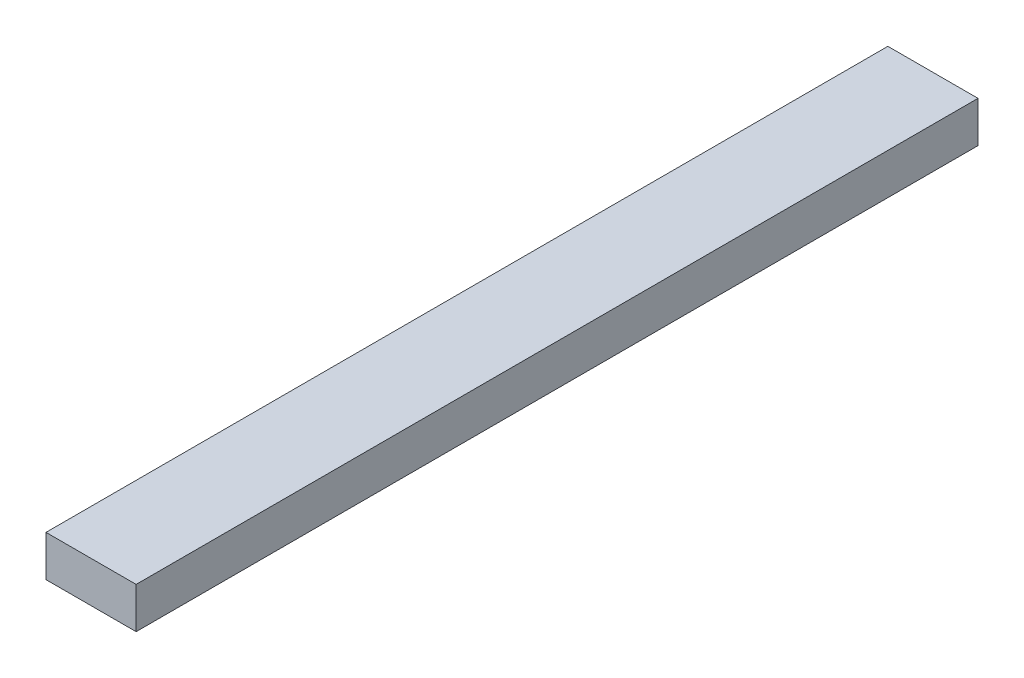
ISO-10303-21;
HEADER;
FILE_DESCRIPTION(('STEP AP214'),'2;1');
FILE_NAME('part.step','',(''),(''),'','','');
FILE_SCHEMA(('AUTOMOTIVE_DESIGN { 1 0 10303 214 1 1 1 1 }'));
ENDSEC;
DATA;
#1=APPLICATION_CONTEXT('core data for automotive mechanical design processes');
#2=APPLICATION_PROTOCOL_DEFINITION('international standard','automotive_design',2000,#1);
#3=PRODUCT_CONTEXT('',#1,'mechanical');
#4=PRODUCT('Part','Part','',(#3));
#5=PRODUCT_RELATED_PRODUCT_CATEGORY('part','',(#4));
#6=PRODUCT_DEFINITION_FORMATION('','',#4);
#7=PRODUCT_DEFINITION_CONTEXT('part definition',#1,'design');
#8=PRODUCT_DEFINITION('design','',#6,#7);
#9=PRODUCT_DEFINITION_SHAPE('','',#8);
#10=(LENGTH_UNIT() NAMED_UNIT(*) SI_UNIT(.MILLI.,.METRE.));
#11=(NAMED_UNIT(*) PLANE_ANGLE_UNIT() SI_UNIT($,.RADIAN.));
#12=(NAMED_UNIT(*) SI_UNIT($,.STERADIAN.) SOLID_ANGLE_UNIT());
#13=UNCERTAINTY_MEASURE_WITH_UNIT(LENGTH_MEASURE(1.E-05),#10,'distance_accuracy_value','');
#14=(GEOMETRIC_REPRESENTATION_CONTEXT(3) GLOBAL_UNCERTAINTY_ASSIGNED_CONTEXT((#13)) GLOBAL_UNIT_ASSIGNED_CONTEXT((#10,
#11,#12)) REPRESENTATION_CONTEXT('',''));
#15=CARTESIAN_POINT('',(0.,0.,0.));
#16=DIRECTION('',(0.,0.,1.));
#17=DIRECTION('',(1.,0.,0.));
#18=AXIS2_PLACEMENT_3D('',#15,#16,#17);
#19=CARTESIAN_POINT('',(0.,0.,-411.));
#20=DIRECTION('',(-1.,0.,0.));
#21=DIRECTION('',(0.,0.,1.));
#22=AXIS2_PLACEMENT_3D('',#19,#20,#21);
#23=PLANE('',#22);
#24=DIRECTION('',(0.,-1.,0.));
#25=VECTOR('',#24,1.);
#26=CARTESIAN_POINT('',(0.,0.,0.));
#27=LINE('',#26,#25);
#28=CARTESIAN_POINT('',(0.,20.,0.));
#29=VERTEX_POINT('',#28);
#30=CARTESIAN_POINT('',(0.,0.,0.));
#31=VERTEX_POINT('',#30);
#32=EDGE_CURVE('E98',#29,#31,#27,.T.);
#33=ORIENTED_EDGE('',*,*,#32,.F.);
#34=DIRECTION('',(0.,0.,1.));
#35=VECTOR('',#34,1.);
#36=CARTESIAN_POINT('',(0.,20.,-411.));
#37=LINE('',#36,#35);
#38=CARTESIAN_POINT('',(0.,20.,-411.));
#39=VERTEX_POINT('',#38);
#40=EDGE_CURVE('E11',#39,#29,#37,.T.);
#41=ORIENTED_EDGE('',*,*,#40,.F.);
#42=DIRECTION('',(0.,-1.,0.));
#43=VECTOR('',#42,1.);
#44=CARTESIAN_POINT('',(0.,0.,-411.));
#45=LINE('',#44,#43);
#46=CARTESIAN_POINT('',(0.,0.,-411.));
#47=VERTEX_POINT('',#46);
#48=EDGE_CURVE('E92',#39,#47,#45,.T.);
#49=ORIENTED_EDGE('',*,*,#48,.T.);
#50=DIRECTION('',(0.,0.,1.));
#51=VECTOR('',#50,1.);
#52=CARTESIAN_POINT('',(0.,0.,-411.));
#53=LINE('',#52,#51);
#54=EDGE_CURVE('E37',#47,#31,#53,.T.);
#55=ORIENTED_EDGE('',*,*,#54,.T.);
#56=EDGE_LOOP('',(#33,#41,#49,#55));
#57=FACE_BOUND('',#56,.T.);
#58=ADVANCED_FACE('F34',(#57),#23,.T.);
#59=CARTESIAN_POINT('',(0.,20.,-411.));
#60=DIRECTION('',(0.,1.,0.));
#61=DIRECTION('',(0.,0.,1.));
#62=AXIS2_PLACEMENT_3D('',#59,#60,#61);
#63=PLANE('',#62);
#64=DIRECTION('',(-1.,0.,0.));
#65=VECTOR('',#64,1.);
#66=CARTESIAN_POINT('',(0.,20.,0.));
#67=LINE('',#66,#65);
#68=CARTESIAN_POINT('',(44.,20.,0.));
#69=VERTEX_POINT('',#68);
#70=EDGE_CURVE('E94',#69,#29,#67,.T.);
#71=ORIENTED_EDGE('',*,*,#70,.F.);
#72=DIRECTION('',(0.,0.,1.));
#73=VECTOR('',#72,1.);
#74=CARTESIAN_POINT('',(44.,20.,-411.));
#75=LINE('',#74,#73);
#76=CARTESIAN_POINT('',(44.,20.,-411.));
#77=VERTEX_POINT('',#76);
#78=EDGE_CURVE('E43',#77,#69,#75,.T.);
#79=ORIENTED_EDGE('',*,*,#78,.F.);
#80=DIRECTION('',(-1.,0.,0.));
#81=VECTOR('',#80,1.);
#82=CARTESIAN_POINT('',(0.,20.,-411.));
#83=LINE('',#82,#81);
#84=EDGE_CURVE('E89',#77,#39,#83,.T.);
#85=ORIENTED_EDGE('',*,*,#84,.T.);
#86=ORIENTED_EDGE('',*,*,#40,.T.);
#87=EDGE_LOOP('',(#71,#79,#85,#86));
#88=FACE_BOUND('',#87,.T.);
#89=ADVANCED_FACE('F108',(#88),#63,.T.);
#90=CARTESIAN_POINT('',(44.,0.,-411.));
#91=DIRECTION('',(1.,0.,0.));
#92=DIRECTION('',(0.,0.,-1.));
#93=AXIS2_PLACEMENT_3D('',#90,#91,#92);
#94=PLANE('',#93);
#95=DIRECTION('',(0.,1.,0.));
#96=VECTOR('',#95,1.);
#97=CARTESIAN_POINT('',(44.,0.,0.));
#98=LINE('',#97,#96);
#99=CARTESIAN_POINT('',(44.,0.,0.));
#100=VERTEX_POINT('',#99);
#101=EDGE_CURVE('E84',#100,#69,#98,.T.);
#102=ORIENTED_EDGE('',*,*,#101,.F.);
#103=DIRECTION('',(0.,0.,1.));
#104=VECTOR('',#103,1.);
#105=CARTESIAN_POINT('',(44.,0.,-411.));
#106=LINE('',#105,#104);
#107=CARTESIAN_POINT('',(44.,0.,-411.));
#108=VERTEX_POINT('',#107);
#109=EDGE_CURVE('E79',#108,#100,#106,.T.);
#110=ORIENTED_EDGE('',*,*,#109,.F.);
#111=DIRECTION('',(0.,1.,0.));
#112=VECTOR('',#111,1.);
#113=CARTESIAN_POINT('',(44.,0.,-411.));
#114=LINE('',#113,#112);
#115=EDGE_CURVE('E82',#108,#77,#114,.T.);
#116=ORIENTED_EDGE('',*,*,#115,.T.);
#117=ORIENTED_EDGE('',*,*,#78,.T.);
#118=EDGE_LOOP('',(#102,#110,#116,#117));
#119=FACE_BOUND('',#118,.T.);
#120=ADVANCED_FACE('F81',(#119),#94,.T.);
#121=CARTESIAN_POINT('',(0.,0.,-411.));
#122=DIRECTION('',(0.,-1.,0.));
#123=DIRECTION('',(0.,0.,-1.));
#124=AXIS2_PLACEMENT_3D('',#121,#122,#123);
#125=PLANE('',#124);
#126=DIRECTION('',(1.,0.,0.));
#127=VECTOR('',#126,1.);
#128=CARTESIAN_POINT('',(0.,0.,0.));
#129=LINE('',#128,#127);
#130=EDGE_CURVE('E101',#31,#100,#129,.T.);
#131=ORIENTED_EDGE('',*,*,#130,.F.);
#132=ORIENTED_EDGE('',*,*,#54,.F.);
#133=DIRECTION('',(1.,0.,0.));
#134=VECTOR('',#133,1.);
#135=CARTESIAN_POINT('',(0.,0.,-411.));
#136=LINE('',#135,#134);
#137=EDGE_CURVE('E88',#47,#108,#136,.T.);
#138=ORIENTED_EDGE('',*,*,#137,.T.);
#139=ORIENTED_EDGE('',*,*,#109,.T.);
#140=EDGE_LOOP('',(#131,#132,#138,#139));
#141=FACE_BOUND('',#140,.T.);
#142=ADVANCED_FACE('F91',(#141),#125,.T.);
#143=CARTESIAN_POINT('',(0.,0.,-411.));
#144=DIRECTION('',(0.,0.,-1.));
#145=DIRECTION('',(-1.,0.,0.));
#146=AXIS2_PLACEMENT_3D('',#143,#144,#145);
#147=PLANE('',#146);
#148=ORIENTED_EDGE('',*,*,#48,.F.);
#149=ORIENTED_EDGE('',*,*,#84,.F.);
#150=ORIENTED_EDGE('',*,*,#115,.F.);
#151=ORIENTED_EDGE('',*,*,#137,.F.);
#152=EDGE_LOOP('',(#148,#149,#150,#151));
#153=FACE_BOUND('',#152,.T.);
#154=ADVANCED_FACE('F87',(#153),#147,.T.);
#155=CARTESIAN_POINT('',(0.,0.,0.));
#156=DIRECTION('',(0.,0.,-1.));
#157=DIRECTION('',(-1.,0.,0.));
#158=AXIS2_PLACEMENT_3D('',#155,#156,#157);
#159=PLANE('',#158);
#160=ORIENTED_EDGE('',*,*,#32,.T.);
#161=ORIENTED_EDGE('',*,*,#130,.T.);
#162=ORIENTED_EDGE('',*,*,#101,.T.);
#163=ORIENTED_EDGE('',*,*,#70,.T.);
#164=EDGE_LOOP('',(#160,#161,#162,#163));
#165=FACE_BOUND('',#164,.T.);
#166=ADVANCED_FACE('F107',(#165),#159,.F.);
#167=CLOSED_SHELL('',(#58,#89,#120,#142,#154,#166));
#168=MANIFOLD_SOLID_BREP('B2',#167);
#169=ADVANCED_BREP_SHAPE_REPRESENTATION('',(#18,#168),#14);
#170=SHAPE_DEFINITION_REPRESENTATION(#9,#169);
ENDSEC;
END-ISO-10303-21;
